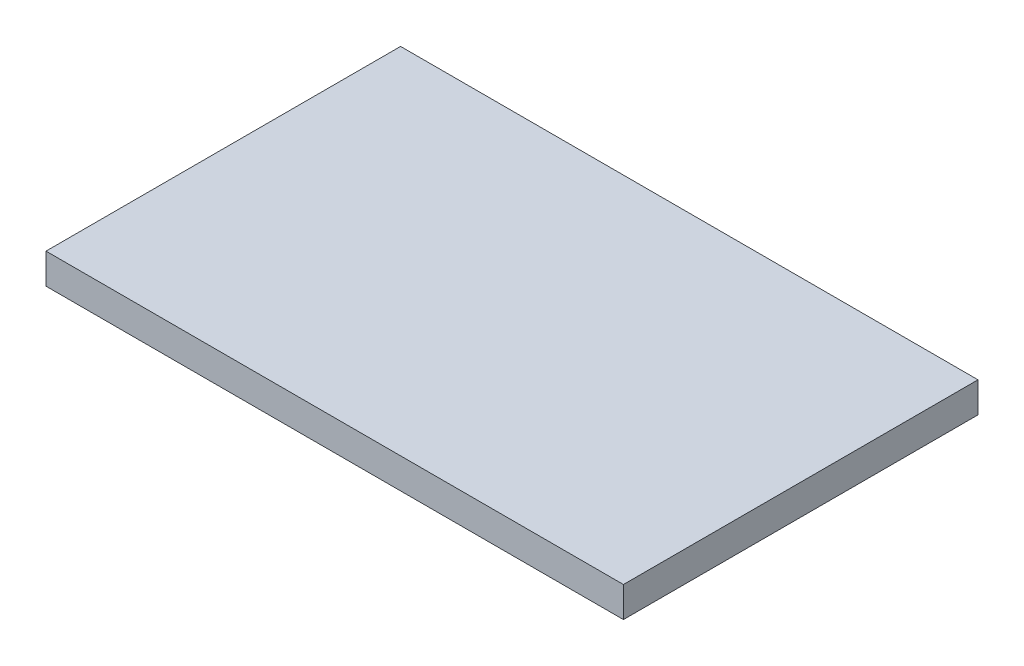
ISO-10303-21;
HEADER;
FILE_DESCRIPTION(('STEP AP214'),'2;1');
FILE_NAME('part.step','',(''),(''),'','','');
FILE_SCHEMA(('AUTOMOTIVE_DESIGN { 1 0 10303 214 1 1 1 1 }'));
ENDSEC;
DATA;
#1=APPLICATION_CONTEXT('core data for automotive mechanical design processes');
#2=APPLICATION_PROTOCOL_DEFINITION('international standard','automotive_design',2000,#1);
#3=PRODUCT_CONTEXT('',#1,'mechanical');
#4=PRODUCT('Part','Part','',(#3));
#5=PRODUCT_RELATED_PRODUCT_CATEGORY('part','',(#4));
#6=PRODUCT_DEFINITION_FORMATION('','',#4);
#7=PRODUCT_DEFINITION_CONTEXT('part definition',#1,'design');
#8=PRODUCT_DEFINITION('design','',#6,#7);
#9=PRODUCT_DEFINITION_SHAPE('','',#8);
#10=(LENGTH_UNIT() NAMED_UNIT(*) SI_UNIT(.MILLI.,.METRE.));
#11=(NAMED_UNIT(*) PLANE_ANGLE_UNIT() SI_UNIT($,.RADIAN.));
#12=(NAMED_UNIT(*) SI_UNIT($,.STERADIAN.) SOLID_ANGLE_UNIT());
#13=UNCERTAINTY_MEASURE_WITH_UNIT(LENGTH_MEASURE(1.E-05),#10,'distance_accuracy_value','');
#14=(GEOMETRIC_REPRESENTATION_CONTEXT(3) GLOBAL_UNCERTAINTY_ASSIGNED_CONTEXT((#13)) GLOBAL_UNIT_ASSIGNED_CONTEXT((#10,
#11,#12)) REPRESENTATION_CONTEXT('',''));
#15=CARTESIAN_POINT('',(0.,0.,0.));
#16=DIRECTION('',(0.,0.,1.));
#17=DIRECTION('',(1.,0.,0.));
#18=AXIS2_PLACEMENT_3D('',#15,#16,#17);
#19=CARTESIAN_POINT('',(0.,30.,0.));
#20=DIRECTION('',(1.,0.,0.));
#21=DIRECTION('',(0.,0.,-1.));
#22=AXIS2_PLACEMENT_3D('',#19,#20,#21);
#23=PLANE('',#22);
#24=DIRECTION('',(0.,0.,1.));
#25=VECTOR('',#24,1.);
#26=CARTESIAN_POINT('',(0.,0.,0.));
#27=LINE('',#26,#25);
#28=CARTESIAN_POINT('',(0.,0.,-350.));
#29=VERTEX_POINT('',#28);
#30=CARTESIAN_POINT('',(0.,0.,0.));
#31=VERTEX_POINT('',#30);
#32=EDGE_CURVE('E98',#29,#31,#27,.T.);
#33=ORIENTED_EDGE('',*,*,#32,.T.);
#34=DIRECTION('',(0.,-1.,0.));
#35=VECTOR('',#34,1.);
#36=CARTESIAN_POINT('',(0.,30.,0.));
#37=LINE('',#36,#35);
#38=CARTESIAN_POINT('',(0.,30.,0.));
#39=VERTEX_POINT('',#38);
#40=EDGE_CURVE('E11',#39,#31,#37,.T.);
#41=ORIENTED_EDGE('',*,*,#40,.F.);
#42=DIRECTION('',(0.,0.,1.));
#43=VECTOR('',#42,1.);
#44=CARTESIAN_POINT('',(0.,30.,0.));
#45=LINE('',#44,#43);
#46=CARTESIAN_POINT('',(0.,30.,-350.));
#47=VERTEX_POINT('',#46);
#48=EDGE_CURVE('E86',#47,#39,#45,.T.);
#49=ORIENTED_EDGE('',*,*,#48,.F.);
#50=DIRECTION('',(0.,-1.,0.));
#51=VECTOR('',#50,1.);
#52=CARTESIAN_POINT('',(0.,30.,-350.));
#53=LINE('',#52,#51);
#54=EDGE_CURVE('E94',#47,#29,#53,.T.);
#55=ORIENTED_EDGE('',*,*,#54,.T.);
#56=EDGE_LOOP('',(#33,#41,#49,#55));
#57=FACE_BOUND('',#56,.T.);
#58=ADVANCED_FACE('F35',(#57),#23,.F.);
#59=CARTESIAN_POINT('',(0.,30.,0.));
#60=DIRECTION('',(0.,0.,-1.));
#61=DIRECTION('',(-1.,0.,0.));
#62=AXIS2_PLACEMENT_3D('',#59,#60,#61);
#63=PLANE('',#62);
#64=DIRECTION('',(1.,0.,0.));
#65=VECTOR('',#64,1.);
#66=CARTESIAN_POINT('',(0.,0.,0.));
#67=LINE('',#66,#65);
#68=CARTESIAN_POINT('',(570.,0.,0.));
#69=VERTEX_POINT('',#68);
#70=EDGE_CURVE('E90',#31,#69,#67,.T.);
#71=ORIENTED_EDGE('',*,*,#70,.T.);
#72=DIRECTION('',(0.,-1.,0.));
#73=VECTOR('',#72,1.);
#74=CARTESIAN_POINT('',(570.,30.,0.));
#75=LINE('',#74,#73);
#76=CARTESIAN_POINT('',(570.,30.,0.));
#77=VERTEX_POINT('',#76);
#78=EDGE_CURVE('E43',#77,#69,#75,.T.);
#79=ORIENTED_EDGE('',*,*,#78,.F.);
#80=DIRECTION('',(1.,0.,0.));
#81=VECTOR('',#80,1.);
#82=CARTESIAN_POINT('',(0.,30.,0.));
#83=LINE('',#82,#81);
#84=EDGE_CURVE('E81',#39,#77,#83,.T.);
#85=ORIENTED_EDGE('',*,*,#84,.F.);
#86=ORIENTED_EDGE('',*,*,#40,.T.);
#87=EDGE_LOOP('',(#71,#79,#85,#86));
#88=FACE_BOUND('',#87,.T.);
#89=ADVANCED_FACE('F89',(#88),#63,.F.);
#90=CARTESIAN_POINT('',(570.,30.,0.));
#91=DIRECTION('',(-1.,0.,0.));
#92=DIRECTION('',(0.,0.,1.));
#93=AXIS2_PLACEMENT_3D('',#90,#91,#92);
#94=PLANE('',#93);
#95=DIRECTION('',(0.,0.,-1.));
#96=VECTOR('',#95,1.);
#97=CARTESIAN_POINT('',(570.,0.,0.));
#98=LINE('',#97,#96);
#99=CARTESIAN_POINT('',(570.,0.,-350.));
#100=VERTEX_POINT('',#99);
#101=EDGE_CURVE('E68',#69,#100,#98,.T.);
#102=ORIENTED_EDGE('',*,*,#101,.T.);
#103=DIRECTION('',(0.,-1.,0.));
#104=VECTOR('',#103,1.);
#105=CARTESIAN_POINT('',(570.,30.,-350.));
#106=LINE('',#105,#104);
#107=CARTESIAN_POINT('',(570.,30.,-350.));
#108=VERTEX_POINT('',#107);
#109=EDGE_CURVE('E91',#108,#100,#106,.T.);
#110=ORIENTED_EDGE('',*,*,#109,.F.);
#111=DIRECTION('',(0.,0.,-1.));
#112=VECTOR('',#111,1.);
#113=CARTESIAN_POINT('',(570.,30.,0.));
#114=LINE('',#113,#112);
#115=EDGE_CURVE('E84',#77,#108,#114,.T.);
#116=ORIENTED_EDGE('',*,*,#115,.F.);
#117=ORIENTED_EDGE('',*,*,#78,.T.);
#118=EDGE_LOOP('',(#102,#110,#116,#117));
#119=FACE_BOUND('',#118,.T.);
#120=ADVANCED_FACE('F92',(#119),#94,.F.);
#121=CARTESIAN_POINT('',(0.,30.,-350.));
#122=DIRECTION('',(0.,0.,1.));
#123=DIRECTION('',(1.,0.,0.));
#124=AXIS2_PLACEMENT_3D('',#121,#122,#123);
#125=PLANE('',#124);
#126=DIRECTION('',(-1.,0.,0.));
#127=VECTOR('',#126,1.);
#128=CARTESIAN_POINT('',(0.,0.,-350.));
#129=LINE('',#128,#127);
#130=EDGE_CURVE('E74',#100,#29,#129,.T.);
#131=ORIENTED_EDGE('',*,*,#130,.T.);
#132=ORIENTED_EDGE('',*,*,#54,.F.);
#133=DIRECTION('',(-1.,0.,0.));
#134=VECTOR('',#133,1.);
#135=CARTESIAN_POINT('',(0.,30.,-350.));
#136=LINE('',#135,#134);
#137=EDGE_CURVE('E51',#108,#47,#136,.T.);
#138=ORIENTED_EDGE('',*,*,#137,.F.);
#139=ORIENTED_EDGE('',*,*,#109,.T.);
#140=EDGE_LOOP('',(#131,#132,#138,#139));
#141=FACE_BOUND('',#140,.T.);
#142=ADVANCED_FACE('F105',(#141),#125,.F.);
#143=CARTESIAN_POINT('',(0.,30.,0.));
#144=DIRECTION('',(0.,-1.,0.));
#145=DIRECTION('',(0.,0.,-1.));
#146=AXIS2_PLACEMENT_3D('',#143,#144,#145);
#147=PLANE('',#146);
#148=ORIENTED_EDGE('',*,*,#48,.T.);
#149=ORIENTED_EDGE('',*,*,#84,.T.);
#150=ORIENTED_EDGE('',*,*,#115,.T.);
#151=ORIENTED_EDGE('',*,*,#137,.T.);
#152=EDGE_LOOP('',(#148,#149,#150,#151));
#153=FACE_BOUND('',#152,.T.);
#154=ADVANCED_FACE('F82',(#153),#147,.F.);
#155=CARTESIAN_POINT('',(0.,0.,0.));
#156=DIRECTION('',(0.,-1.,0.));
#157=DIRECTION('',(0.,0.,-1.));
#158=AXIS2_PLACEMENT_3D('',#155,#156,#157);
#159=PLANE('',#158);
#160=ORIENTED_EDGE('',*,*,#32,.F.);
#161=ORIENTED_EDGE('',*,*,#130,.F.);
#162=ORIENTED_EDGE('',*,*,#101,.F.);
#163=ORIENTED_EDGE('',*,*,#70,.F.);
#164=EDGE_LOOP('',(#160,#161,#162,#163));
#165=FACE_BOUND('',#164,.T.);
#166=ADVANCED_FACE('F108',(#165),#159,.T.);
#167=CLOSED_SHELL('',(#58,#89,#120,#142,#154,#166));
#168=MANIFOLD_SOLID_BREP('B2',#167);
#169=ADVANCED_BREP_SHAPE_REPRESENTATION('',(#18,#168),#14);
#170=SHAPE_DEFINITION_REPRESENTATION(#9,#169);
ENDSEC;
END-ISO-10303-21;
